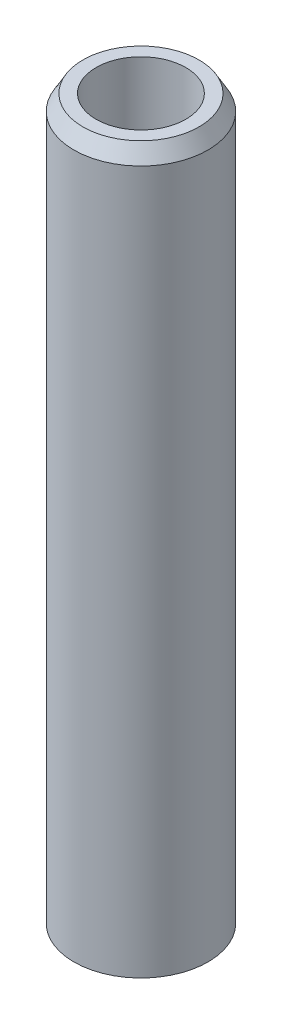
ISO-10303-21;
HEADER;
FILE_DESCRIPTION(('STEP AP214'),'2;1');
FILE_NAME('part.step','',(''),(''),'','','');
FILE_SCHEMA(('AUTOMOTIVE_DESIGN { 1 0 10303 214 1 1 1 1 }'));
ENDSEC;
DATA;
#1=APPLICATION_CONTEXT('core data for automotive mechanical design processes');
#2=APPLICATION_PROTOCOL_DEFINITION('international standard','automotive_design',2000,#1);
#3=PRODUCT_CONTEXT('',#1,'mechanical');
#4=PRODUCT('Part','Part','',(#3));
#5=PRODUCT_RELATED_PRODUCT_CATEGORY('part','',(#4));
#6=PRODUCT_DEFINITION_FORMATION('','',#4);
#7=PRODUCT_DEFINITION_CONTEXT('part definition',#1,'design');
#8=PRODUCT_DEFINITION('design','',#6,#7);
#9=PRODUCT_DEFINITION_SHAPE('','',#8);
#10=(LENGTH_UNIT() NAMED_UNIT(*) SI_UNIT(.MILLI.,.METRE.));
#11=(NAMED_UNIT(*) PLANE_ANGLE_UNIT() SI_UNIT($,.RADIAN.));
#12=(NAMED_UNIT(*) SI_UNIT($,.STERADIAN.) SOLID_ANGLE_UNIT());
#13=UNCERTAINTY_MEASURE_WITH_UNIT(LENGTH_MEASURE(1.E-05),#10,'distance_accuracy_value','');
#14=(GEOMETRIC_REPRESENTATION_CONTEXT(3) GLOBAL_UNCERTAINTY_ASSIGNED_CONTEXT((#13)) GLOBAL_UNIT_ASSIGNED_CONTEXT((#10,
#11,#12)) REPRESENTATION_CONTEXT('',''));
#15=CARTESIAN_POINT('',(0.,0.,0.));
#16=DIRECTION('',(0.,0.,1.));
#17=DIRECTION('',(1.,0.,0.));
#18=AXIS2_PLACEMENT_3D('',#15,#16,#17);
#19=CARTESIAN_POINT('',(0.,108.565487077259,0.));
#20=DIRECTION('',(0.,-1.,0.));
#21=DIRECTION('',(0.,0.,-1.));
#22=AXIS2_PLACEMENT_3D('',#19,#20,#21);
#23=CYLINDRICAL_SURFACE('',#22,10.);
#24=CARTESIAN_POINT('',(0.,106.246082385377,0.));
#25=DIRECTION('',(0.,1.,0.));
#26=DIRECTION('',(0.,0.,1.));
#27=AXIS2_PLACEMENT_3D('',#24,#25,#26);
#28=CIRCLE('',#27,10.);
#29=CARTESIAN_POINT('',(0.,106.246082385377,10.));
#30=VERTEX_POINT('',#29);
#31=EDGE_CURVE('E50',#30,#30,#28,.F.);
#32=ORIENTED_EDGE('',*,*,#31,.T.);
#33=EDGE_LOOP('',(#32));
#34=FACE_BOUND('',#33,.T.);
#35=CARTESIAN_POINT('',(0.,1.33910892321794,0.));
#36=DIRECTION('',(0.,1.,0.));
#37=DIRECTION('',(0.,0.,1.));
#38=AXIS2_PLACEMENT_3D('',#35,#36,#37);
#39=CIRCLE('',#38,10.);
#40=CARTESIAN_POINT('',(0.,1.33910892321794,10.));
#41=VERTEX_POINT('',#40);
#42=EDGE_CURVE('E51',#41,#41,#39,.T.);
#43=ORIENTED_EDGE('',*,*,#42,.T.);
#44=EDGE_LOOP('',(#43));
#45=FACE_BOUND('',#44,.T.);
#46=ADVANCED_FACE('F39',(#34,#45),#23,.T.);
#47=CARTESIAN_POINT('',(0.,108.565487077259,0.));
#48=DIRECTION('',(0.,1.,0.));
#49=DIRECTION('',(0.,0.,1.));
#50=AXIS2_PLACEMENT_3D('',#47,#48,#49);
#51=PLANE('',#50);
#52=CARTESIAN_POINT('',(0.,108.565487077259,0.));
#53=DIRECTION('',(0.,1.,0.));
#54=DIRECTION('',(0.,0.,1.));
#55=AXIS2_PLACEMENT_3D('',#52,#53,#54);
#56=CIRCLE('',#55,8.66089107678204);
#57=CARTESIAN_POINT('',(0.,108.565487077259,8.66089107678204));
#58=VERTEX_POINT('',#57);
#59=EDGE_CURVE('E54',#58,#58,#56,.T.);
#60=ORIENTED_EDGE('',*,*,#59,.T.);
#61=EDGE_LOOP('',(#60));
#62=FACE_BOUND('',#61,.T.);
#63=CARTESIAN_POINT('',(0.,108.565487077259,0.));
#64=DIRECTION('',(0.,1.,0.));
#65=DIRECTION('',(0.,0.,1.));
#66=AXIS2_PLACEMENT_3D('',#63,#64,#65);
#67=CIRCLE('',#66,6.695791622459);
#68=CARTESIAN_POINT('',(0.,108.565487077259,6.695791622459));
#69=VERTEX_POINT('',#68);
#70=EDGE_CURVE('E58',#69,#69,#67,.T.);
#71=ORIENTED_EDGE('',*,*,#70,.F.);
#72=EDGE_LOOP('',(#71));
#73=FACE_BOUND('',#72,.T.);
#74=ADVANCED_FACE('F69',(#62,#73),#51,.T.);
#75=CARTESIAN_POINT('',(0.,0.,0.));
#76=DIRECTION('',(0.,1.,0.));
#77=DIRECTION('',(0.,0.,1.));
#78=AXIS2_PLACEMENT_3D('',#75,#76,#77);
#79=PLANE('',#78);
#80=CARTESIAN_POINT('',(0.,0.,0.));
#81=DIRECTION('',(0.,1.,0.));
#82=DIRECTION('',(0.,0.,1.));
#83=AXIS2_PLACEMENT_3D('',#80,#81,#82);
#84=CIRCLE('',#83,7.68059530811767);
#85=CARTESIAN_POINT('',(0.,0.,7.68059530811767));
#86=VERTEX_POINT('',#85);
#87=EDGE_CURVE('E10',#86,#86,#84,.F.);
#88=ORIENTED_EDGE('',*,*,#87,.T.);
#89=EDGE_LOOP('',(#88));
#90=FACE_BOUND('',#89,.T.);
#91=CARTESIAN_POINT('',(0.,0.,0.));
#92=DIRECTION('',(0.,1.,0.));
#93=DIRECTION('',(0.,0.,1.));
#94=AXIS2_PLACEMENT_3D('',#91,#92,#93);
#95=CIRCLE('',#94,6.695791622459);
#96=CARTESIAN_POINT('',(0.,0.,6.695791622459));
#97=VERTEX_POINT('',#96);
#98=EDGE_CURVE('E63',#97,#97,#95,.T.);
#99=ORIENTED_EDGE('',*,*,#98,.T.);
#100=EDGE_LOOP('',(#99));
#101=FACE_BOUND('',#100,.T.);
#102=ADVANCED_FACE('F75',(#90,#101),#79,.F.);
#103=CARTESIAN_POINT('',(0.,108.565487077259,0.));
#104=DIRECTION('',(0.,-1.,0.));
#105=DIRECTION('',(0.,0.,-1.));
#106=AXIS2_PLACEMENT_3D('',#103,#104,#105);
#107=CYLINDRICAL_SURFACE('',#106,6.695791622459);
#108=ORIENTED_EDGE('',*,*,#70,.T.);
#109=EDGE_LOOP('',(#108));
#110=FACE_BOUND('',#109,.T.);
#111=ORIENTED_EDGE('',*,*,#98,.F.);
#112=EDGE_LOOP('',(#111));
#113=FACE_BOUND('',#112,.T.);
#114=ADVANCED_FACE('F70',(#110,#113),#107,.F.);
#115=CARTESIAN_POINT('',(0.,108.565487077259,0.));
#116=DIRECTION('',(0.,-1.,0.));
#117=DIRECTION('',(0.,0.,-1.));
#118=AXIS2_PLACEMENT_3D('',#115,#116,#117);
#119=CONICAL_SURFACE('',#118,8.66089107678204,0.523598775598296);
#120=ORIENTED_EDGE('',*,*,#31,.F.);
#121=EDGE_LOOP('',(#120));
#122=FACE_BOUND('',#121,.T.);
#123=ORIENTED_EDGE('',*,*,#59,.F.);
#124=EDGE_LOOP('',(#123));
#125=FACE_BOUND('',#124,.T.);
#126=ADVANCED_FACE('F81',(#122,#125),#119,.T.);
#127=CARTESIAN_POINT('',(0.,1.33910892321794,0.));
#128=DIRECTION('',(0.,1.,0.));
#129=DIRECTION('',(0.,0.,1.));
#130=AXIS2_PLACEMENT_3D('',#127,#128,#129);
#131=CONICAL_SURFACE('',#130,10.,1.0471975511966);
#132=ORIENTED_EDGE('',*,*,#87,.F.);
#133=EDGE_LOOP('',(#132));
#134=FACE_BOUND('',#133,.T.);
#135=ORIENTED_EDGE('',*,*,#42,.F.);
#136=EDGE_LOOP('',(#135));
#137=FACE_BOUND('',#136,.T.);
#138=ADVANCED_FACE('F45',(#134,#137),#131,.T.);
#139=CLOSED_SHELL('',(#46,#74,#102,#114,#126,#138));
#140=MANIFOLD_SOLID_BREP('B2',#139);
#141=ADVANCED_BREP_SHAPE_REPRESENTATION('',(#18,#140),#14);
#142=SHAPE_DEFINITION_REPRESENTATION(#9,#141);
ENDSEC;
END-ISO-10303-21;
